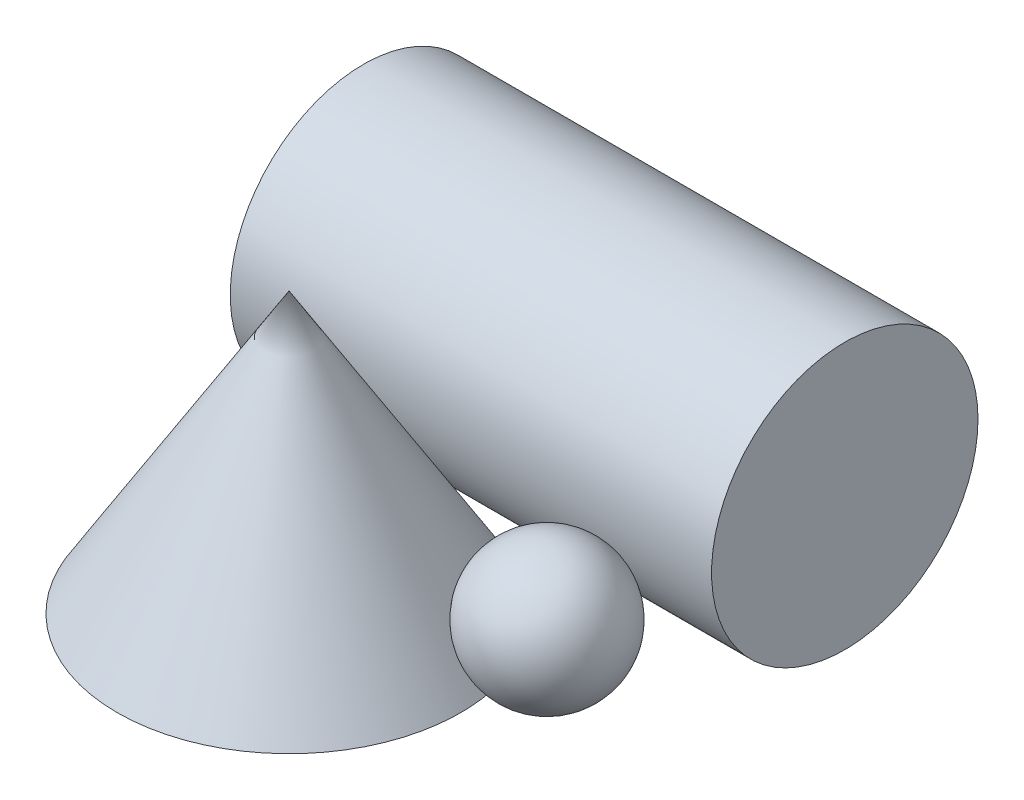
ISO-10303-21;
HEADER;
FILE_DESCRIPTION(('STEP AP214'),'2;1');
FILE_NAME('part.step','',(''),(''),'','','');
FILE_SCHEMA(('AUTOMOTIVE_DESIGN { 1 0 10303 214 1 1 1 1 }'));
ENDSEC;
DATA;
#1=APPLICATION_CONTEXT('core data for automotive mechanical design processes');
#2=APPLICATION_PROTOCOL_DEFINITION('international standard','automotive_design',2000,#1);
#3=PRODUCT_CONTEXT('',#1,'mechanical');
#4=PRODUCT('Part','Part','',(#3));
#5=PRODUCT_RELATED_PRODUCT_CATEGORY('part','',(#4));
#6=PRODUCT_DEFINITION_FORMATION('','',#4);
#7=PRODUCT_DEFINITION_CONTEXT('part definition',#1,'design');
#8=PRODUCT_DEFINITION('design','',#6,#7);
#9=PRODUCT_DEFINITION_SHAPE('','',#8);
#10=(LENGTH_UNIT() NAMED_UNIT(*) SI_UNIT(.MILLI.,.METRE.));
#11=(NAMED_UNIT(*) PLANE_ANGLE_UNIT() SI_UNIT($,.RADIAN.));
#12=(NAMED_UNIT(*) SI_UNIT($,.STERADIAN.) SOLID_ANGLE_UNIT());
#13=UNCERTAINTY_MEASURE_WITH_UNIT(LENGTH_MEASURE(1.E-05),#10,'distance_accuracy_value','');
#14=(GEOMETRIC_REPRESENTATION_CONTEXT(3) GLOBAL_UNCERTAINTY_ASSIGNED_CONTEXT((#13)) GLOBAL_UNIT_ASSIGNED_CONTEXT((#10,
#11,#12)) REPRESENTATION_CONTEXT('',''));
#15=CARTESIAN_POINT('',(0.,0.,0.));
#16=DIRECTION('',(0.,0.,1.));
#17=DIRECTION('',(1.,0.,0.));
#18=AXIS2_PLACEMENT_3D('',#15,#16,#17);
#19=CARTESIAN_POINT('',(47.2424837903006,16.,-12.7805361124895));
#20=DIRECTION('',(1.,0.,0.));
#21=DIRECTION('',(0.,0.,1.));
#22=AXIS2_PLACEMENT_3D('',#19,#20,#21);
#23=SPHERICAL_SURFACE('',#22,16.);
#24=CARTESIAN_POINT('',(63.2424837903006,16.,-12.7805361124895));
#25=VERTEX_POINT('',#24);
#26=VERTEX_LOOP('',#25);
#27=FACE_BOUND('',#26,.T.);
#28=ADVANCED_FACE('F37',(#27),#23,.T.);
#29=CLOSED_SHELL('',(#28));
#30=MANIFOLD_SOLID_BREP('B2',#29);
#31=CARTESIAN_POINT('',(72.,31.,-57.3226510151297));
#32=DIRECTION('',(-1.,0.,0.));
#33=DIRECTION('',(0.,0.,1.));
#34=AXIS2_PLACEMENT_3D('',#31,#32,#33);
#35=CYLINDRICAL_SURFACE('',#34,31.);
#36=CARTESIAN_POINT('',(72.,31.,-57.3226510151297));
#37=DIRECTION('',(1.,0.,0.));
#38=DIRECTION('',(0.,0.,-1.));
#39=AXIS2_PLACEMENT_3D('',#36,#37,#38);
#40=CIRCLE('',#39,31.);
#41=CARTESIAN_POINT('',(72.,31.,-88.3226510151297));
#42=VERTEX_POINT('',#41);
#43=EDGE_CURVE('E36',#42,#42,#40,.T.);
#44=ORIENTED_EDGE('',*,*,#43,.F.);
#45=EDGE_LOOP('',(#44));
#46=FACE_BOUND('',#45,.T.);
#47=CARTESIAN_POINT('',(-40.,31.,-57.3226510151297));
#48=DIRECTION('',(1.,0.,0.));
#49=DIRECTION('',(0.,0.,-1.));
#50=AXIS2_PLACEMENT_3D('',#47,#48,#49);
#51=CIRCLE('',#50,31.);
#52=CARTESIAN_POINT('',(-40.,31.,-88.3226510151297));
#53=VERTEX_POINT('',#52);
#54=EDGE_CURVE('E64',#53,#53,#51,.T.);
#55=ORIENTED_EDGE('',*,*,#54,.T.);
#56=EDGE_LOOP('',(#55));
#57=FACE_BOUND('',#56,.T.);
#58=ADVANCED_FACE('F58',(#46,#57),#35,.T.);
#59=CARTESIAN_POINT('',(72.,31.,-57.3226510151297));
#60=DIRECTION('',(1.,0.,0.));
#61=DIRECTION('',(0.,0.,-1.));
#62=AXIS2_PLACEMENT_3D('',#59,#60,#61);
#63=PLANE('',#62);
#64=ORIENTED_EDGE('',*,*,#43,.T.);
#65=EDGE_LOOP('',(#64));
#66=FACE_BOUND('',#65,.T.);
#67=ADVANCED_FACE('F73',(#66),#63,.T.);
#68=CARTESIAN_POINT('',(-40.,31.,-57.3226510151297));
#69=DIRECTION('',(1.,0.,0.));
#70=DIRECTION('',(0.,0.,-1.));
#71=AXIS2_PLACEMENT_3D('',#68,#69,#70);
#72=PLANE('',#71);
#73=ORIENTED_EDGE('',*,*,#54,.F.);
#74=EDGE_LOOP('',(#73));
#75=FACE_BOUND('',#74,.T.);
#76=ADVANCED_FACE('F71',(#75),#72,.F.);
#77=CLOSED_SHELL('',(#58,#67,#76));
#78=MANIFOLD_SOLID_BREP('B6',#77);
#79=CARTESIAN_POINT('',(0.,65.,0.));
#80=DIRECTION('',(0.,-1.,0.));
#81=DIRECTION('',(0.,0.,-1.));
#82=AXIS2_PLACEMENT_3D('',#79,#80,#81);
#83=CONICAL_SURFACE('',#82,0.,0.551654982528547);
#84=CARTESIAN_POINT('',(0.,0.,0.));
#85=DIRECTION('',(0.,-1.,0.));
#86=DIRECTION('',(0.,0.,-1.));
#87=AXIS2_PLACEMENT_3D('',#84,#85,#86);
#88=CIRCLE('',#87,40.);
#89=CARTESIAN_POINT('',(0.,0.,-40.));
#90=VERTEX_POINT('',#89);
#91=EDGE_CURVE('E56',#90,#90,#88,.T.);
#92=ORIENTED_EDGE('',*,*,#91,.F.);
#93=EDGE_LOOP('',(#92));
#94=FACE_BOUND('',#93,.T.);
#95=CARTESIAN_POINT('',(0.,65.,0.));
#96=VERTEX_POINT('',#95);
#97=VERTEX_LOOP('',#96);
#98=FACE_BOUND('',#97,.T.);
#99=ADVANCED_FACE('F98',(#94,#98),#83,.T.);
#100=CARTESIAN_POINT('',(40.,0.,0.));
#101=DIRECTION('',(0.,1.,0.));
#102=DIRECTION('',(0.,0.,1.));
#103=AXIS2_PLACEMENT_3D('',#100,#101,#102);
#104=PLANE('',#103);
#105=ORIENTED_EDGE('',*,*,#91,.T.);
#106=EDGE_LOOP('',(#105));
#107=FACE_BOUND('',#106,.T.);
#108=ADVANCED_FACE('F106',(#107),#104,.F.);
#109=CLOSED_SHELL('',(#99,#108));
#110=MANIFOLD_SOLID_BREP('B31',#109);
#111=ADVANCED_BREP_SHAPE_REPRESENTATION('',(#18,#30,#78,#110),#14);
#112=SHAPE_DEFINITION_REPRESENTATION(#9,#111);
ENDSEC;
END-ISO-10303-21;
